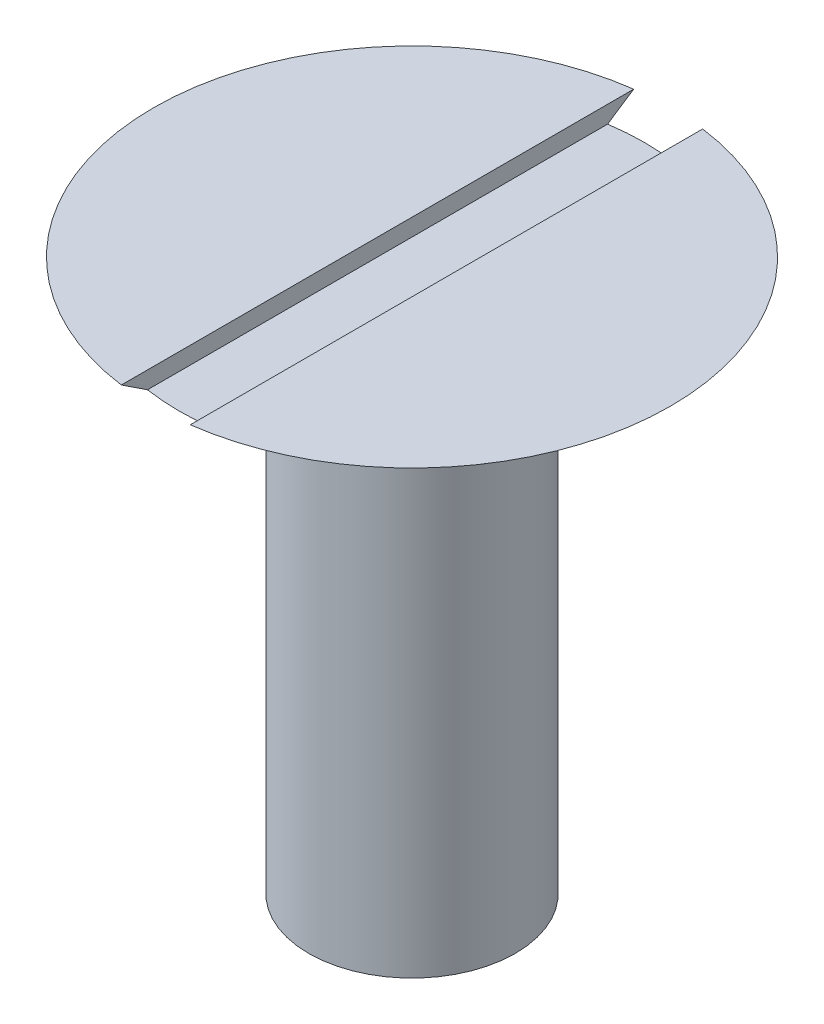
ISO-10303-21;
HEADER;
FILE_DESCRIPTION(('STEP AP214'),'2;1');
FILE_NAME('part.step','',(''),(''),'','','');
FILE_SCHEMA(('AUTOMOTIVE_DESIGN { 1 0 10303 214 1 1 1 1 }'));
ENDSEC;
DATA;
#1=APPLICATION_CONTEXT('core data for automotive mechanical design processes');
#2=APPLICATION_PROTOCOL_DEFINITION('international standard','automotive_design',2000,#1);
#3=PRODUCT_CONTEXT('',#1,'mechanical');
#4=PRODUCT('Part','Part','',(#3));
#5=PRODUCT_RELATED_PRODUCT_CATEGORY('part','',(#4));
#6=PRODUCT_DEFINITION_FORMATION('','',#4);
#7=PRODUCT_DEFINITION_CONTEXT('part definition',#1,'design');
#8=PRODUCT_DEFINITION('design','',#6,#7);
#9=PRODUCT_DEFINITION_SHAPE('','',#8);
#10=(LENGTH_UNIT() NAMED_UNIT(*) SI_UNIT(.MILLI.,.METRE.));
#11=(NAMED_UNIT(*) PLANE_ANGLE_UNIT() SI_UNIT($,.RADIAN.));
#12=(NAMED_UNIT(*) SI_UNIT($,.STERADIAN.) SOLID_ANGLE_UNIT());
#13=UNCERTAINTY_MEASURE_WITH_UNIT(LENGTH_MEASURE(1.E-05),#10,'distance_accuracy_value','');
#14=(GEOMETRIC_REPRESENTATION_CONTEXT(3) GLOBAL_UNCERTAINTY_ASSIGNED_CONTEXT((#13)) GLOBAL_UNIT_ASSIGNED_CONTEXT((#10,
#11,#12)) REPRESENTATION_CONTEXT('',''));
#15=CARTESIAN_POINT('',(0.,0.,0.));
#16=DIRECTION('',(0.,0.,1.));
#17=DIRECTION('',(1.,0.,0.));
#18=AXIS2_PLACEMENT_3D('',#15,#16,#17);
#19=CARTESIAN_POINT('',(7.5,17.7320508075689,0.));
#20=DIRECTION('',(0.,-1.,0.));
#21=DIRECTION('',(1.,0.,0.));
#22=AXIS2_PLACEMENT_3D('',#19,#20,#21);
#23=PLANE('',#22);
#24=CARTESIAN_POINT('',(0.,17.7320508075689,0.));
#25=DIRECTION('',(0.,1.,0.));
#26=DIRECTION('',(-1.,0.,0.));
#27=AXIS2_PLACEMENT_3D('',#24,#25,#26);
#28=CIRCLE('',#27,7.5);
#29=CARTESIAN_POINT('',(1.,17.7320508075689,7.43303437365925));
#30=VERTEX_POINT('',#29);
#31=CARTESIAN_POINT('',(1.,17.7320508075689,-7.43303437365926));
#32=VERTEX_POINT('',#31);
#33=EDGE_CURVE('E105',#30,#32,#28,.T.);
#34=ORIENTED_EDGE('',*,*,#33,.T.);
#35=DIRECTION('',(0.,0.,1.));
#36=VECTOR('',#35,1.);
#37=CARTESIAN_POINT('',(1.,17.7320508075689,0.));
#38=LINE('',#37,#36);
#39=EDGE_CURVE('E117',#32,#30,#38,.T.);
#40=ORIENTED_EDGE('',*,*,#39,.T.);
#41=EDGE_LOOP('',(#34,#40));
#42=FACE_BOUND('',#41,.T.);
#43=ADVANCED_FACE('F33',(#42),#23,.F.);
#44=CARTESIAN_POINT('',(-1.,17.7320508075689,-7.43303437365925));
#45=VERTEX_POINT('',#44);
#46=CARTESIAN_POINT('',(-1.,17.7320508075689,7.43303437365925));
#47=VERTEX_POINT('',#46);
#48=EDGE_CURVE('E97',#45,#47,#28,.T.);
#49=ORIENTED_EDGE('',*,*,#48,.T.);
#50=DIRECTION('',(0.,0.,-1.));
#51=VECTOR('',#50,1.);
#52=CARTESIAN_POINT('',(-1.,17.7320508075689,0.));
#53=LINE('',#52,#51);
#54=EDGE_CURVE('E53',#47,#45,#53,.T.);
#55=ORIENTED_EDGE('',*,*,#54,.T.);
#56=EDGE_LOOP('',(#49,#55));
#57=FACE_BOUND('',#56,.T.);
#58=ADVANCED_FACE('F35',(#57),#23,.F.);
#59=CARTESIAN_POINT('',(0.,14.7320508075689,0.));
#60=DIRECTION('',(0.,1.,0.));
#61=DIRECTION('',(-1.,0.,0.));
#62=AXIS2_PLACEMENT_3D('',#59,#60,#61);
#63=CONICAL_SURFACE('',#62,3.,0.982793723247328);
#64=CARTESIAN_POINT('',(0.,17.2320508075689,0.));
#65=DIRECTION('',(0.,-1.,0.));
#66=DIRECTION('',(0.,0.,-1.));
#67=AXIS2_PLACEMENT_3D('',#64,#65,#66);
#68=CIRCLE('',#67,6.75);
#69=CARTESIAN_POINT('',(-1.,17.2320508075689,-6.67551496140934));
#70=VERTEX_POINT('',#69);
#71=CARTESIAN_POINT('',(1.,17.2320508075689,-6.67551496140934));
#72=VERTEX_POINT('',#71);
#73=EDGE_CURVE('E46',#70,#72,#68,.T.);
#74=ORIENTED_EDGE('',*,*,#73,.T.);
#75=CARTESIAN_POINT('',(1.,23.7556937065117,16.5051986118822));
#76=CARTESIAN_POINT('',(1.,23.3603479318067,15.9110829340255));
#77=CARTESIAN_POINT('',(1.,22.9650478329272,15.3169368485818));
#78=CARTESIAN_POINT('',(1.,22.174601923094,14.1285413772797));
#79=CARTESIAN_POINT('',(1.,21.7794561122633,13.5342919913396));
#80=CARTESIAN_POINT('',(1.,20.9895722076472,12.3459340233908));
#81=CARTESIAN_POINT('',(1.,20.5948340091817,11.751825510979));
#82=CARTESIAN_POINT('',(1.,19.8057019968011,10.5633803518874));
#83=CARTESIAN_POINT('',(1.,19.4113081826821,9.96904370534314));
#84=CARTESIAN_POINT('',(1.,18.5678799725852,8.6967476329911));
#85=CARTESIAN_POINT('',(1.,18.1189282537543,8.01873334029489));
#86=CARTESIAN_POINT('',(1.,17.4465609793348,7.0008486014262));
#87=CARTESIAN_POINT('',(1.,17.2225779756932,6.66135306835351));
#88=CARTESIAN_POINT('',(1.,16.7752109137544,5.98196894822864));
#89=CARTESIAN_POINT('',(1.,16.5518268533279,5.64208036257988));
#90=CARTESIAN_POINT('',(1.,16.2014854841346,5.10729631880633));
#91=CARTESIAN_POINT('',(1.,16.0741890421407,4.91262309113847));
#92=CARTESIAN_POINT('',(1.,15.8200649904605,4.52297096814373));
#93=CARTESIAN_POINT('',(1.,15.6932373801811,4.3279920732039));
#94=CARTESIAN_POINT('',(1.,15.4403600032924,3.93772992197851));
#95=CARTESIAN_POINT('',(1.,15.3143097416866,3.74244698659525));
#96=CARTESIAN_POINT('',(1.,15.0632638349866,3.35120969463487));
#97=CARTESIAN_POINT('',(1.,14.9382681620987,3.15525535594518));
#98=CARTESIAN_POINT('',(1.,14.7425472866508,2.84534956700158));
#99=CARTESIAN_POINT('',(1.,14.6712305605098,2.73177205141226));
#100=CARTESIAN_POINT('',(1.,14.5294348495622,2.5040941840594));
#101=CARTESIAN_POINT('',(1.,14.4589558644007,2.38999383251733));
#102=CARTESIAN_POINT('',(1.,14.3190666197307,2.16079301774553));
#103=CARTESIAN_POINT('',(1.,14.2496590561042,2.04569090522812));
#104=CARTESIAN_POINT('',(1.,14.1127342436248,1.8143885034993));
#105=CARTESIAN_POINT('',(1.,14.0452166485921,1.69818842068461));
#106=CARTESIAN_POINT('',(1.,13.9312059182147,1.49582944442028));
#107=CARTESIAN_POINT('',(1.,13.8839835732192,1.41008408598925));
#108=CARTESIAN_POINT('',(1.,13.7920536509127,1.23726988782899));
#109=CARTESIAN_POINT('',(1.,13.7473455877872,1.15020130793378));
#110=CARTESIAN_POINT('',(1.,13.6618986656659,0.97419382439251));
#111=CARTESIAN_POINT('',(1.,13.6211558425988,0.885256899004599));
#112=CARTESIAN_POINT('',(1.,13.5649864387311,0.749825303702303));
#113=CARTESIAN_POINT('',(1.,13.5470929525753,0.704360339887695));
#114=CARTESIAN_POINT('',(1.,13.5134634356562,0.612644839868881));
#115=CARTESIAN_POINT('',(1.,13.4977268122346,0.566394523403818));
#116=CARTESIAN_POINT('',(1.,13.4677688845234,0.468944614281099));
#117=CARTESIAN_POINT('',(1.,13.4538002483194,0.417665765315433));
#118=CARTESIAN_POINT('',(1.,13.43008715035,0.314134251248072));
#119=CARTESIAN_POINT('',(1.,13.4203412037596,0.261881935198549));
#120=CARTESIAN_POINT('',(1.,13.4060368856689,0.15709776009304));
#121=CARTESIAN_POINT('',(1.,13.4014354936476,0.10457196669955));
#122=CARTESIAN_POINT('',(1.,13.3977973129642,-0.00067575905090674));
#123=CARTESIAN_POINT('',(1.,13.3987601515841,-0.0533976780340504));
#124=CARTESIAN_POINT('',(1.,13.4061232461768,-0.158299082290195));
#125=CARTESIAN_POINT('',(1.,13.4125083881832,-0.210479667637757));
#126=CARTESIAN_POINT('',(1.,13.4300162670842,-0.314032180675549));
#127=CARTESIAN_POINT('',(1.,13.4411405181423,-0.365403844467805));
#128=CARTESIAN_POINT('',(1.,13.4673411356115,-0.467678472285774));
#129=CARTESIAN_POINT('',(1.,13.4824575778934,-0.518570932190949));
#130=CARTESIAN_POINT('',(1.,13.5156809468704,-0.619346376192605));
#131=CARTESIAN_POINT('',(1.,13.533787539146,-0.669229472477161));
#132=CARTESIAN_POINT('',(1.,13.5741800996689,-0.773053984896543));
#133=CARTESIAN_POINT('',(1.,13.5967029546127,-0.826902242567284));
#134=CARTESIAN_POINT('',(1.,13.6437598632341,-0.933717824984113));
#135=CARTESIAN_POINT('',(1.,13.6682943902754,-0.986684938842147));
#136=CARTESIAN_POINT('',(1.,13.7441452895017,-1.14461433050563));
#137=CARTESIAN_POINT('',(1.,13.7976699888559,-1.2485103128592));
#138=CARTESIAN_POINT('',(1.,13.9082297477832,-1.45477140625263));
#139=CARTESIAN_POINT('',(1.,13.9652746617089,-1.55713112081458));
#140=CARTESIAN_POINT('',(1.,14.0814424092823,-1.7605911159592));
#141=CARTESIAN_POINT('',(1.,14.1405641594358,-1.86169201704912));
#142=CARTESIAN_POINT('',(1.,14.260315736753,-2.06329205636191));
#143=CARTESIAN_POINT('',(1.,14.3209485850757,-2.1637893901409));
#144=CARTESIAN_POINT('',(1.,14.4431745947034,-2.36421461110617));
#145=CARTESIAN_POINT('',(1.,14.5047678756726,-2.46414242518106));
#146=CARTESIAN_POINT('',(1.,14.6285176966721,-2.66338617676229));
#147=CARTESIAN_POINT('',(1.,14.6906729514391,-2.76270291396497));
#148=CARTESIAN_POINT('',(1.,14.8154829496661,-2.96101584351584));
#149=CARTESIAN_POINT('',(1.,14.8781376718754,-3.06001204925216));
#150=CARTESIAN_POINT('',(1.,15.065275598559,-3.35445671958563));
#151=CARTESIAN_POINT('',(1.,15.190305335842,-3.54955763562542));
#152=CARTESIAN_POINT('',(1.,15.441266299877,-3.93917920246957));
#153=CARTESIAN_POINT('',(1.,15.5671975325405,-4.13369984945687));
#154=CARTESIAN_POINT('',(1.,15.9458747519322,-4.71670478614755));
#155=CARTESIAN_POINT('',(1.,16.1994964700912,-5.10461991903317));
#156=CARTESIAN_POINT('',(1.,16.7080673901268,-5.87998488352165));
#157=CARTESIAN_POINT('',(1.,16.9630174306946,-6.26743416356278));
#158=CARTESIAN_POINT('',(1.,17.4735847596916,-7.04188493205998));
#159=CARTESIAN_POINT('',(1.,17.7292020385478,-7.42888642682678));
#160=CARTESIAN_POINT('',(1.,18.2400523643285,-8.20140560911866));
#161=CARTESIAN_POINT('',(1.,18.4952841154795,-8.58692415404817));
#162=CARTESIAN_POINT('',(1.,19.0060259073876,-9.35777893808794));
#163=CARTESIAN_POINT('',(1.,19.261535949192,-9.74311517650425));
#164=CARTESIAN_POINT('',(1.,20.0282502045721,-10.8987840227036));
#165=CARTESIAN_POINT('',(1.,20.5397386818994,-11.668928016092));
#166=CARTESIAN_POINT('',(1.,21.2764728692599,-12.777588737132));
#167=CARTESIAN_POINT('',(1.,21.5015549795033,-13.1162142352005));
#168=CARTESIAN_POINT('',(1.,21.9517946437241,-13.7934373561615));
#169=CARTESIAN_POINT('',(1.,22.176952200675,-14.1320349770772));
#170=CARTESIAN_POINT('',(1.,22.6276879319917,-14.8097508666834));
#171=CARTESIAN_POINT('',(1.,22.8532661909062,-15.1488690791379));
#172=CARTESIAN_POINT('',(1.,23.3044552133827,-15.8270614952769));
#173=CARTESIAN_POINT('',(1.,23.530065974985,-16.1661357002652));
#174=CARTESIAN_POINT('',(1.,23.7556937065117,-16.5051986118822));
#175=B_SPLINE_CURVE_WITH_KNOTS('',3,(#75,#76,#77,#78,#79,#80,#81,#82,#83,#84,#85,#86,#87,#88,
#89,#90,#91,#92,#93,#94,#95,#96,#97,#98,#99,#100,#101,#102,#103,#104,#105,#106,#107,#108,#109,
#110,#111,#112,#113,#114,#115,#116,#117,#118,#119,#120,#121,#122,#123,#124,#125,#126,#127,#128,
#129,#130,#131,#132,#133,#134,#135,#136,#137,#138,#139,#140,#141,#142,#143,#144,#145,#146,#147,
#148,#149,#150,#151,#152,#153,#154,#155,#156,#157,#158,#159,#160,#161,#162,#163,#164,#165,#166,
#167,#168,#169,#170,#171,#172,#173,#174),.UNSPECIFIED.,.F.,.F.,(4,2,2,2,2,2,2,2,2,2,2,2,2,2,2,2,
2,2,2,2,2,2,2,2,2,2,2,2,2,2,2,2,2,2,2,2,2,2,2,2,2,2,2,2,2,2,2,2,2,4),(0.,2.14089829943798,
4.28179830181943,6.42166933902809,8.56153910739072,11.0010765306831,12.2212526260955,
13.4414243781317,14.1392193807156,14.8370135004517,15.5343043917754,16.2315768482332,
16.6339093596946,17.0362417007439,17.4394602137233,17.8426043806052,18.1362418978992,
18.4298224816441,18.7231064898163,18.8696438383942,19.0161408406719,19.1754423987767,
19.3346878961033,19.4925915290212,19.6504845849408,19.8079389736155,19.9654437073477,
20.1245939870508,20.2837264793659,20.4587765082395,20.6338678467474,20.9843562541538,
21.3358747179592,21.6872124399948,22.039320161037,22.3914721088895,22.7429581859988,
23.0944293876148,23.7896017029184,24.4847785810835,25.8751756414241,27.2665946487374,
28.6579938016603,30.0450445618079,31.4321005598366,34.2056683662405,35.4254891186106,
36.6453655246979,37.8672412996805,39.0890611643819),.UNSPECIFIED.);
#176=EDGE_CURVE('E11',#72,#32,#175,.T.);
#177=ORIENTED_EDGE('',*,*,#176,.T.);
#178=ORIENTED_EDGE('',*,*,#33,.F.);
#179=CARTESIAN_POINT('',(1.,17.2320508075689,6.67551496140934));
#180=VERTEX_POINT('',#179);
#181=EDGE_CURVE('E37',#30,#180,#175,.T.);
#182=ORIENTED_EDGE('',*,*,#181,.T.);
#183=CARTESIAN_POINT('',(-1.,17.2320508075689,6.67551496140935));
#184=VERTEX_POINT('',#183);
#185=EDGE_CURVE('E89',#180,#184,#68,.T.);
#186=ORIENTED_EDGE('',*,*,#185,.T.);
#187=CARTESIAN_POINT('',(-1.,23.7556937065117,-16.5051986118822));
#188=CARTESIAN_POINT('',(-1.,23.3603479318067,-15.9110829340255));
#189=CARTESIAN_POINT('',(-1.,22.9650478329272,-15.3169368485818));
#190=CARTESIAN_POINT('',(-1.,22.174601923094,-14.1285413772797));
#191=CARTESIAN_POINT('',(-1.,21.7794561122633,-13.5342919913396));
#192=CARTESIAN_POINT('',(-1.,20.9895722076472,-12.3459340233908));
#193=CARTESIAN_POINT('',(-1.,20.5948340091817,-11.751825510979));
#194=CARTESIAN_POINT('',(-1.,19.8057019968011,-10.5633803518874));
#195=CARTESIAN_POINT('',(-1.,19.4113081826821,-9.96904370534313));
#196=CARTESIAN_POINT('',(-1.,18.5678799725852,-8.69674763299109));
#197=CARTESIAN_POINT('',(-1.,18.1189282537543,-8.01873334029488));
#198=CARTESIAN_POINT('',(-1.,17.4465609793348,-7.00084860142619));
#199=CARTESIAN_POINT('',(-1.,17.2225779756932,-6.6613530683535));
#200=CARTESIAN_POINT('',(-1.,16.7752109137544,-5.98196894822863));
#201=CARTESIAN_POINT('',(-1.,16.5518268533279,-5.64208036257987));
#202=CARTESIAN_POINT('',(-1.,16.2014854841346,-5.10729631880633));
#203=CARTESIAN_POINT('',(-1.,16.0741890421407,-4.91262309113846));
#204=CARTESIAN_POINT('',(-1.,15.8200649904605,-4.52297096814372));
#205=CARTESIAN_POINT('',(-1.,15.6932373801811,-4.32799207320389));
#206=CARTESIAN_POINT('',(-1.,15.4403600032924,-3.9377299219785));
#207=CARTESIAN_POINT('',(-1.,15.3143097416866,-3.74244698659524));
#208=CARTESIAN_POINT('',(-1.,15.0632638349865,-3.35120969463486));
#209=CARTESIAN_POINT('',(-1.,14.9382681620987,-3.15525535594518));
#210=CARTESIAN_POINT('',(-1.,14.7425472866508,-2.84534956700158));
#211=CARTESIAN_POINT('',(-1.,14.6712305605098,-2.73177205141226));
#212=CARTESIAN_POINT('',(-1.,14.5294348495622,-2.5040941840594));
#213=CARTESIAN_POINT('',(-1.,14.4589558644007,-2.38999383251733));
#214=CARTESIAN_POINT('',(-1.,14.3190666197307,-2.16079301774553));
#215=CARTESIAN_POINT('',(-1.,14.2496590561042,-2.04569090522811));
#216=CARTESIAN_POINT('',(-1.,14.1127342436248,-1.81438850349929));
#217=CARTESIAN_POINT('',(-1.,14.0452166485921,-1.69818842068461));
#218=CARTESIAN_POINT('',(-1.,13.9312059182147,-1.49582944442027));
#219=CARTESIAN_POINT('',(-1.,13.8839835732192,-1.41008408598925));
#220=CARTESIAN_POINT('',(-1.,13.7920536509127,-1.23726988782898));
#221=CARTESIAN_POINT('',(-1.,13.7473455877872,-1.15020130793377));
#222=CARTESIAN_POINT('',(-1.,13.6618986656659,-0.974193824392508));
#223=CARTESIAN_POINT('',(-1.,13.6211558425988,-0.885256899004597));
#224=CARTESIAN_POINT('',(-1.,13.5649864387311,-0.749825303702303));
#225=CARTESIAN_POINT('',(-1.,13.5470929525753,-0.704360339887695));
#226=CARTESIAN_POINT('',(-1.,13.5134634356562,-0.612644839868882));
#227=CARTESIAN_POINT('',(-1.,13.4977268122346,-0.566394523403818));
#228=CARTESIAN_POINT('',(-1.,13.4677688845234,-0.468944614281099));
#229=CARTESIAN_POINT('',(-1.,13.4538002483194,-0.417665765315432));
#230=CARTESIAN_POINT('',(-1.,13.43008715035,-0.314134251248072));
#231=CARTESIAN_POINT('',(-1.,13.4203412037596,-0.261881935198549));
#232=CARTESIAN_POINT('',(-1.,13.4060368856689,-0.157097760093042));
#233=CARTESIAN_POINT('',(-1.,13.4014354936476,-0.104571966699554));
#234=CARTESIAN_POINT('',(-1.,13.3977973129642,0.000675759050903135));
#235=CARTESIAN_POINT('',(-1.,13.3987601515841,0.0533976780340479));
#236=CARTESIAN_POINT('',(-1.,13.4061232461768,0.158299082290194));
#237=CARTESIAN_POINT('',(-1.,13.4125083881832,0.210479667637757));
#238=CARTESIAN_POINT('',(-1.,13.4300162670842,0.314032180675549));
#239=CARTESIAN_POINT('',(-1.,13.4411405181423,0.365403844467804));
#240=CARTESIAN_POINT('',(-1.,13.4673411356115,0.467678472285772));
#241=CARTESIAN_POINT('',(-1.,13.4824575778934,0.518570932190946));
#242=CARTESIAN_POINT('',(-1.,13.5156809468704,0.619346376192602));
#243=CARTESIAN_POINT('',(-1.,13.533787539146,0.669229472477159));
#244=CARTESIAN_POINT('',(-1.,13.5741800996689,0.77305398489654));
#245=CARTESIAN_POINT('',(-1.,13.5967029546127,0.826902242567282));
#246=CARTESIAN_POINT('',(-1.,13.6437598632341,0.93371782498411));
#247=CARTESIAN_POINT('',(-1.,13.6682943902754,0.986684938842142));
#248=CARTESIAN_POINT('',(-1.,13.7441452895017,1.14461433050562));
#249=CARTESIAN_POINT('',(-1.,13.7976699888559,1.24851031285919));
#250=CARTESIAN_POINT('',(-1.,13.9082297477832,1.45477140625263));
#251=CARTESIAN_POINT('',(-1.,13.9652746617089,1.55713112081458));
#252=CARTESIAN_POINT('',(-1.,14.0814424092823,1.7605911159592));
#253=CARTESIAN_POINT('',(-1.,14.1405641594358,1.86169201704911));
#254=CARTESIAN_POINT('',(-1.,14.260315736753,2.0632920563619));
#255=CARTESIAN_POINT('',(-1.,14.3209485850757,2.16378939014089));
#256=CARTESIAN_POINT('',(-1.,14.4431745947034,2.36421461110617));
#257=CARTESIAN_POINT('',(-1.,14.5047678756726,2.46414242518106));
#258=CARTESIAN_POINT('',(-1.,14.6285176966721,2.66338617676229));
#259=CARTESIAN_POINT('',(-1.,14.6906729514391,2.76270291396496));
#260=CARTESIAN_POINT('',(-1.,14.8154829496661,2.96101584351584));
#261=CARTESIAN_POINT('',(-1.,14.8781376718754,3.06001204925216));
#262=CARTESIAN_POINT('',(-1.,15.0652755985589,3.35445671958563));
#263=CARTESIAN_POINT('',(-1.,15.190305335842,3.54955763562542));
#264=CARTESIAN_POINT('',(-1.,15.441266299877,3.93917920246956));
#265=CARTESIAN_POINT('',(-1.,15.5671975325405,4.13369984945687));
#266=CARTESIAN_POINT('',(-1.,15.9458747519322,4.71670478614754));
#267=CARTESIAN_POINT('',(-1.,16.1994964700912,5.10461991903316));
#268=CARTESIAN_POINT('',(-1.,16.7080673901268,5.87998488352163));
#269=CARTESIAN_POINT('',(-1.,16.9630174306946,6.26743416356276));
#270=CARTESIAN_POINT('',(-1.,17.4735847596916,7.04188493205997));
#271=CARTESIAN_POINT('',(-1.,17.7292020385478,7.42888642682677));
#272=CARTESIAN_POINT('',(-1.,18.2400523643285,8.20140560911865));
#273=CARTESIAN_POINT('',(-1.,18.4952841154794,8.58692415404816));
#274=CARTESIAN_POINT('',(-1.,19.0060259073876,9.35777893808792));
#275=CARTESIAN_POINT('',(-1.,19.261535949192,9.74311517650423));
#276=CARTESIAN_POINT('',(-1.,20.0282502045721,10.8987840227036));
#277=CARTESIAN_POINT('',(-1.,20.5397386818994,11.668928016092));
#278=CARTESIAN_POINT('',(-1.,21.2764728692599,12.7775887371319));
#279=CARTESIAN_POINT('',(-1.,21.5015549795033,13.1162142352005));
#280=CARTESIAN_POINT('',(-1.,21.9517946437241,13.7934373561615));
#281=CARTESIAN_POINT('',(-1.,22.176952200675,14.1320349770772));
#282=CARTESIAN_POINT('',(-1.,22.6276879319917,14.8097508666834));
#283=CARTESIAN_POINT('',(-1.,22.8532661909062,15.1488690791379));
#284=CARTESIAN_POINT('',(-1.,23.3044552133827,15.8270614952769));
#285=CARTESIAN_POINT('',(-1.,23.530065974985,16.1661357002652));
#286=CARTESIAN_POINT('',(-1.,23.7556937065117,16.5051986118822));
#287=B_SPLINE_CURVE_WITH_KNOTS('',3,(#187,#188,#189,#190,#191,#192,#193,#194,#195,#196,#197,
#198,#199,#200,#201,#202,#203,#204,#205,#206,#207,#208,#209,#210,#211,#212,#213,#214,#215,#216,
#217,#218,#219,#220,#221,#222,#223,#224,#225,#226,#227,#228,#229,#230,#231,#232,#233,#234,#235,
#236,#237,#238,#239,#240,#241,#242,#243,#244,#245,#246,#247,#248,#249,#250,#251,#252,#253,#254,
#255,#256,#257,#258,#259,#260,#261,#262,#263,#264,#265,#266,#267,#268,#269,#270,#271,#272,#273,
#274,#275,#276,#277,#278,#279,#280,#281,#282,#283,#284,#285,#286),.UNSPECIFIED.,.F.,.F.,(4,2,2,
2,2,2,2,2,2,2,2,2,2,2,2,2,2,2,2,2,2,2,2,2,2,2,2,2,2,2,2,2,2,2,2,2,2,2,2,2,2,2,2,2,2,2,2,2,2,4),
(0.,2.14089829943799,4.28179830181944,6.42166933902811,8.56153910739074,11.0010765306831,
12.2212526260955,13.4414243781317,14.1392193807156,14.8370135004517,15.5343043917754,
16.2315768482332,16.6339093596946,17.0362417007439,17.4394602137233,17.8426043806053,
18.1362418978992,18.4298224816441,18.7231064898163,18.8696438383942,19.0161408406719,
19.1754423987767,19.3346878961033,19.4925915290212,19.6504845849408,19.8079389736155,
19.9654437073477,20.1245939870508,20.2837264793659,20.4587765082395,20.6338678467473,
20.9843562541538,21.3358747179592,21.6872124399948,22.039320161037,22.3914721088895,
22.7429581859988,23.0944293876148,23.7896017029184,24.4847785810835,25.8751756414241,
27.2665946487374,28.6579938016603,30.0450445618079,31.4321005598365,34.2056683662404,
35.4254891186106,36.6453655246979,37.8672412996805,39.0890611643819),.UNSPECIFIED.);
#288=EDGE_CURVE('E91',#184,#47,#287,.T.);
#289=ORIENTED_EDGE('',*,*,#288,.T.);
#290=ORIENTED_EDGE('',*,*,#48,.F.);
#291=EDGE_CURVE('E88',#45,#70,#287,.T.);
#292=ORIENTED_EDGE('',*,*,#291,.T.);
#293=EDGE_LOOP('',(#74,#177,#178,#182,#186,#289,#290,#292));
#294=FACE_BOUND('',#293,.T.);
#295=CARTESIAN_POINT('',(0.,14.7320508075689,0.));
#296=DIRECTION('',(0.,1.,0.));
#297=DIRECTION('',(-1.,0.,0.));
#298=AXIS2_PLACEMENT_3D('',#295,#296,#297);
#299=CIRCLE('',#298,3.);
#300=CARTESIAN_POINT('',(-3.,14.7320508075689,0.));
#301=VERTEX_POINT('',#300);
#302=EDGE_CURVE('E110',#301,#301,#299,.T.);
#303=ORIENTED_EDGE('',*,*,#302,.T.);
#304=EDGE_LOOP('',(#303));
#305=FACE_BOUND('',#304,.T.);
#306=ADVANCED_FACE('F94',(#294,#305),#63,.T.);
#307=CARTESIAN_POINT('',(0.,17.7320508075689,0.));
#308=DIRECTION('',(0.,1.,0.));
#309=DIRECTION('',(-1.,0.,0.));
#310=AXIS2_PLACEMENT_3D('',#307,#308,#309);
#311=CYLINDRICAL_SURFACE('',#310,3.);
#312=ORIENTED_EDGE('',*,*,#302,.F.);
#313=EDGE_LOOP('',(#312));
#314=FACE_BOUND('',#313,.T.);
#315=CARTESIAN_POINT('',(0.,1.7320508075689,0.));
#316=DIRECTION('',(0.,1.,0.));
#317=DIRECTION('',(-1.,0.,0.));
#318=AXIS2_PLACEMENT_3D('',#315,#316,#317);
#319=CIRCLE('',#318,3.);
#320=CARTESIAN_POINT('',(-3.,1.7320508075689,0.));
#321=VERTEX_POINT('',#320);
#322=EDGE_CURVE('E114',#321,#321,#319,.T.);
#323=ORIENTED_EDGE('',*,*,#322,.T.);
#324=EDGE_LOOP('',(#323));
#325=FACE_BOUND('',#324,.T.);
#326=ADVANCED_FACE('F130',(#314,#325),#311,.T.);
#327=CARTESIAN_POINT('',(0.,0.,0.));
#328=DIRECTION('',(0.,1.,0.));
#329=DIRECTION('',(-1.,0.,0.));
#330=AXIS2_PLACEMENT_3D('',#327,#328,#329);
#331=CONICAL_SURFACE('',#330,0.,1.04719755119659);
#332=ORIENTED_EDGE('',*,*,#322,.F.);
#333=EDGE_LOOP('',(#332));
#334=FACE_BOUND('',#333,.T.);
#335=CARTESIAN_POINT('',(0.,0.,0.));
#336=VERTEX_POINT('',#335);
#337=VERTEX_LOOP('',#336);
#338=FACE_BOUND('',#337,.T.);
#339=ADVANCED_FACE('F134',(#334,#338),#331,.T.);
#340=CARTESIAN_POINT('',(1.,17.2320508075689,-7.5));
#341=DIRECTION('',(1.,0.,0.));
#342=DIRECTION('',(0.,0.,-1.));
#343=AXIS2_PLACEMENT_3D('',#340,#341,#342);
#344=PLANE('',#343);
#345=ORIENTED_EDGE('',*,*,#39,.F.);
#346=ORIENTED_EDGE('',*,*,#176,.F.);
#347=DIRECTION('',(0.,0.,1.));
#348=VECTOR('',#347,1.);
#349=CARTESIAN_POINT('',(1.,17.2320508075689,-7.5));
#350=LINE('',#349,#348);
#351=EDGE_CURVE('E85',#72,#180,#350,.T.);
#352=ORIENTED_EDGE('',*,*,#351,.T.);
#353=ORIENTED_EDGE('',*,*,#181,.F.);
#354=EDGE_LOOP('',(#345,#346,#352,#353));
#355=FACE_BOUND('',#354,.T.);
#356=ADVANCED_FACE('F121',(#355),#344,.F.);
#357=CARTESIAN_POINT('',(-1.,17.2320508075689,-7.5));
#358=DIRECTION('',(0.,-1.,0.));
#359=DIRECTION('',(0.,0.,-1.));
#360=AXIS2_PLACEMENT_3D('',#357,#358,#359);
#361=PLANE('',#360);
#362=ORIENTED_EDGE('',*,*,#351,.F.);
#363=ORIENTED_EDGE('',*,*,#73,.F.);
#364=DIRECTION('',(0.,0.,1.));
#365=VECTOR('',#364,1.);
#366=CARTESIAN_POINT('',(-1.,17.2320508075689,-7.5));
#367=LINE('',#366,#365);
#368=EDGE_CURVE('E82',#70,#184,#367,.T.);
#369=ORIENTED_EDGE('',*,*,#368,.T.);
#370=ORIENTED_EDGE('',*,*,#185,.F.);
#371=EDGE_LOOP('',(#362,#363,#369,#370));
#372=FACE_BOUND('',#371,.T.);
#373=ADVANCED_FACE('F81',(#372),#361,.F.);
#374=CARTESIAN_POINT('',(-1.,17.2320508075689,-7.5));
#375=DIRECTION('',(-1.,0.,0.));
#376=DIRECTION('',(0.,0.,1.));
#377=AXIS2_PLACEMENT_3D('',#374,#375,#376);
#378=PLANE('',#377);
#379=ORIENTED_EDGE('',*,*,#54,.F.);
#380=ORIENTED_EDGE('',*,*,#288,.F.);
#381=ORIENTED_EDGE('',*,*,#368,.F.);
#382=ORIENTED_EDGE('',*,*,#291,.F.);
#383=EDGE_LOOP('',(#379,#380,#381,#382));
#384=FACE_BOUND('',#383,.T.);
#385=ADVANCED_FACE('F90',(#384),#378,.F.);
#386=CLOSED_SHELL('',(#43,#58,#306,#326,#339,#356,#373,#385));
#387=MANIFOLD_SOLID_BREP('B2',#386);
#388=ADVANCED_BREP_SHAPE_REPRESENTATION('',(#18,#387),#14);
#389=SHAPE_DEFINITION_REPRESENTATION(#9,#388);
ENDSEC;
END-ISO-10303-21;
